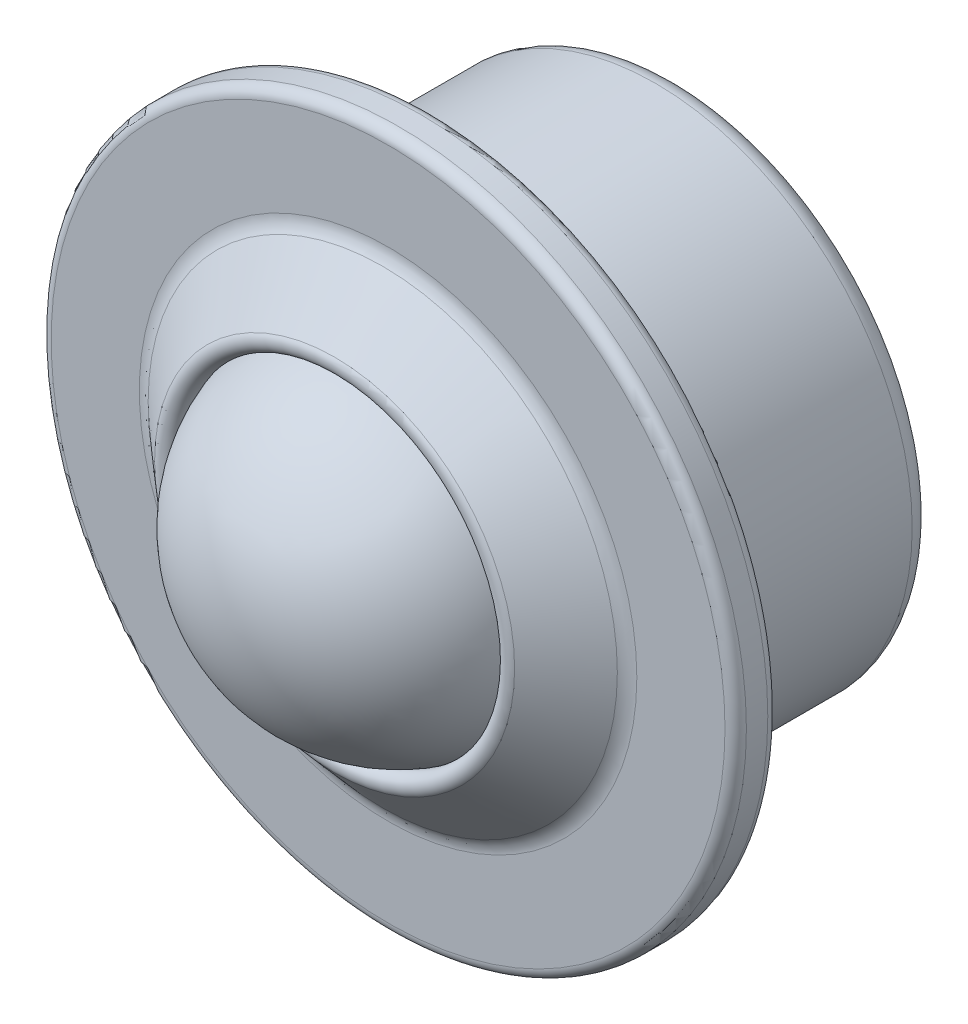
ISO-10303-21;
HEADER;
FILE_DESCRIPTION(('STEP AP214'),'2;1');
FILE_NAME('part.step','',(''),(''),'','','');
FILE_SCHEMA(('AUTOMOTIVE_DESIGN { 1 0 10303 214 1 1 1 1 }'));
ENDSEC;
DATA;
#1=APPLICATION_CONTEXT('core data for automotive mechanical design processes');
#2=APPLICATION_PROTOCOL_DEFINITION('international standard','automotive_design',2000,#1);
#3=PRODUCT_CONTEXT('',#1,'mechanical');
#4=PRODUCT('Part','Part','',(#3));
#5=PRODUCT_RELATED_PRODUCT_CATEGORY('part','',(#4));
#6=PRODUCT_DEFINITION_FORMATION('','',#4);
#7=PRODUCT_DEFINITION_CONTEXT('part definition',#1,'design');
#8=PRODUCT_DEFINITION('design','',#6,#7);
#9=PRODUCT_DEFINITION_SHAPE('','',#8);
#10=(LENGTH_UNIT() NAMED_UNIT(*) SI_UNIT(.MILLI.,.METRE.));
#11=(NAMED_UNIT(*) PLANE_ANGLE_UNIT() SI_UNIT($,.RADIAN.));
#12=(NAMED_UNIT(*) SI_UNIT($,.STERADIAN.) SOLID_ANGLE_UNIT());
#13=UNCERTAINTY_MEASURE_WITH_UNIT(LENGTH_MEASURE(1.E-05),#10,'distance_accuracy_value','');
#14=(GEOMETRIC_REPRESENTATION_CONTEXT(3) GLOBAL_UNCERTAINTY_ASSIGNED_CONTEXT((#13)) GLOBAL_UNIT_ASSIGNED_CONTEXT((#10,
#11,#12)) REPRESENTATION_CONTEXT('',''));
#15=CARTESIAN_POINT('',(0.,0.,0.));
#16=DIRECTION('',(0.,0.,1.));
#17=DIRECTION('',(1.,0.,0.));
#18=AXIS2_PLACEMENT_3D('',#15,#16,#17);
#19=CARTESIAN_POINT('',(0.,0.,0.));
#20=DIRECTION('',(0.,0.,-1.));
#21=DIRECTION('',(-1.,0.,0.));
#22=AXIS2_PLACEMENT_3D('',#19,#20,#21);
#23=PLANE('',#22);
#24=CARTESIAN_POINT('',(0.,0.,0.));
#25=DIRECTION('',(0.,0.,-1.));
#26=DIRECTION('',(-1.,0.,0.));
#27=AXIS2_PLACEMENT_3D('',#24,#25,#26);
#28=CIRCLE('',#27,11.);
#29=CARTESIAN_POINT('',(-11.,0.,0.));
#30=VERTEX_POINT('',#29);
#31=EDGE_CURVE('E43',#30,#30,#28,.T.);
#32=ORIENTED_EDGE('',*,*,#31,.T.);
#33=EDGE_LOOP('',(#32));
#34=FACE_BOUND('',#33,.T.);
#35=ADVANCED_FACE('F23',(#34),#23,.T.);
#36=CARTESIAN_POINT('',(0.,0.,13.));
#37=DIRECTION('',(0.,0.,1.));
#38=DIRECTION('',(-1.,0.,0.));
#39=AXIS2_PLACEMENT_3D('',#36,#37,#38);
#40=SPHERICAL_SURFACE('',#39,8.);
#41=CARTESIAN_POINT('',(0.,0.,15.4705863482928));
#42=DIRECTION('',(0.,0.,1.));
#43=DIRECTION('',(1.,0.,0.));
#44=AXIS2_PLACEMENT_3D('',#41,#42,#43);
#45=CIRCLE('',#44,7.60895545364996);
#46=CARTESIAN_POINT('',(7.60895545364996,0.,15.4705863482927));
#47=VERTEX_POINT('',#46);
#48=EDGE_CURVE('E55',#47,#47,#45,.T.);
#49=ORIENTED_EDGE('',*,*,#48,.T.);
#50=EDGE_LOOP('',(#49));
#51=FACE_BOUND('',#50,.T.);
#52=ADVANCED_FACE('F84',(#51),#40,.T.);
#53=CARTESIAN_POINT('',(0.,0.,15.6249979950611));
#54=DIRECTION('',(0.,0.,1.));
#55=DIRECTION('',(1.,0.,0.));
#56=AXIS2_PLACEMENT_3D('',#53,#54,#55);
#57=TOROIDAL_SURFACE('',#56,8.08451516950308,0.5);
#58=CARTESIAN_POINT('',(0.,0.,16.));
#59=DIRECTION('',(0.,0.,1.));
#60=DIRECTION('',(1.,0.,0.));
#61=AXIS2_PLACEMENT_3D('',#58,#59,#60);
#62=CIRCLE('',#61,8.41523180998521);
#63=CARTESIAN_POINT('',(8.41523180998521,0.,16.));
#64=VERTEX_POINT('',#63);
#65=EDGE_CURVE('E58',#64,#64,#62,.T.);
#66=ORIENTED_EDGE('',*,*,#65,.T.);
#67=EDGE_LOOP('',(#66));
#68=FACE_BOUND('',#67,.T.);
#69=ORIENTED_EDGE('',*,*,#48,.F.);
#70=EDGE_LOOP('',(#69));
#71=FACE_BOUND('',#70,.T.);
#72=ADVANCED_FACE('F90',(#68,#71),#57,.T.);
#73=CARTESIAN_POINT('',(0.,0.,16.));
#74=DIRECTION('',(0.,0.,-1.));
#75=DIRECTION('',(-1.,0.,0.));
#76=AXIS2_PLACEMENT_3D('',#73,#74,#75);
#77=CONICAL_SURFACE('',#76,8.41523180998521,0.848068141367787);
#78=CARTESIAN_POINT('',(0.,0.,13.7499959901222));
#79=DIRECTION('',(0.,0.,-1.));
#80=DIRECTION('',(-1.,0.,0.));
#81=AXIS2_PLACEMENT_3D('',#78,#79,#80);
#82=CIRCLE('',#81,10.9665277278282);
#83=CARTESIAN_POINT('',(-10.9665277278282,0.,13.7499959901222));
#84=VERTEX_POINT('',#83);
#85=EDGE_CURVE('E52',#84,#84,#82,.F.);
#86=ORIENTED_EDGE('',*,*,#85,.T.);
#87=EDGE_LOOP('',(#86));
#88=FACE_BOUND('',#87,.T.);
#89=ORIENTED_EDGE('',*,*,#65,.F.);
#90=EDGE_LOOP('',(#89));
#91=FACE_BOUND('',#90,.T.);
#92=ADVANCED_FACE('F114',(#88,#91),#77,.T.);
#93=CARTESIAN_POINT('',(-16.25,0.,13.5));
#94=DIRECTION('',(0.,0.,1.));
#95=DIRECTION('',(1.,0.,0.));
#96=AXIS2_PLACEMENT_3D('',#93,#94,#95);
#97=PLANE('',#96);
#98=CARTESIAN_POINT('',(0.,0.,13.5));
#99=DIRECTION('',(0.,0.,1.));
#100=DIRECTION('',(1.,0.,0.));
#101=AXIS2_PLACEMENT_3D('',#98,#99,#100);
#102=CIRCLE('',#101,15.75);
#103=CARTESIAN_POINT('',(15.75,0.,13.5));
#104=VERTEX_POINT('',#103);
#105=EDGE_CURVE('E30',#104,#104,#102,.T.);
#106=ORIENTED_EDGE('',*,*,#105,.T.);
#107=EDGE_LOOP('',(#106));
#108=FACE_BOUND('',#107,.T.);
#109=CARTESIAN_POINT('',(0.,0.,13.5));
#110=DIRECTION('',(0.,0.,1.));
#111=DIRECTION('',(1.,0.,0.));
#112=AXIS2_PLACEMENT_3D('',#109,#110,#111);
#113=CIRCLE('',#112,11.6279610087925);
#114=CARTESIAN_POINT('',(11.6279610087925,0.,13.5));
#115=VERTEX_POINT('',#114);
#116=EDGE_CURVE('E49',#115,#115,#113,.F.);
#117=ORIENTED_EDGE('',*,*,#116,.T.);
#118=EDGE_LOOP('',(#117));
#119=FACE_BOUND('',#118,.T.);
#120=ADVANCED_FACE('F109',(#108,#119),#97,.T.);
#121=CARTESIAN_POINT('',(0.,0.,-2.1));
#122=DIRECTION('',(0.,0.,1.));
#123=DIRECTION('',(1.,0.,0.));
#124=AXIS2_PLACEMENT_3D('',#121,#122,#123);
#125=CYLINDRICAL_SURFACE('',#124,16.25);
#126=CARTESIAN_POINT('',(0.,0.,13.));
#127=DIRECTION('',(0.,0.,1.));
#128=DIRECTION('',(1.,0.,0.));
#129=AXIS2_PLACEMENT_3D('',#126,#127,#128);
#130=CIRCLE('',#129,16.25);
#131=CARTESIAN_POINT('',(16.25,0.,13.));
#132=VERTEX_POINT('',#131);
#133=EDGE_CURVE('E12',#132,#132,#130,.F.);
#134=ORIENTED_EDGE('',*,*,#133,.T.);
#135=EDGE_LOOP('',(#134));
#136=FACE_BOUND('',#135,.T.);
#137=CARTESIAN_POINT('',(0.,0.,12.));
#138=DIRECTION('',(0.,0.,-1.));
#139=DIRECTION('',(-1.,0.,0.));
#140=AXIS2_PLACEMENT_3D('',#137,#138,#139);
#141=CIRCLE('',#140,16.25);
#142=CARTESIAN_POINT('',(-16.25,0.,12.));
#143=VERTEX_POINT('',#142);
#144=EDGE_CURVE('E38',#143,#143,#141,.F.);
#145=ORIENTED_EDGE('',*,*,#144,.T.);
#146=EDGE_LOOP('',(#145));
#147=FACE_BOUND('',#146,.T.);
#148=ADVANCED_FACE('F80',(#136,#147),#125,.T.);
#149=CARTESIAN_POINT('',(-12.,0.,11.5));
#150=DIRECTION('',(0.,0.,-1.));
#151=DIRECTION('',(-1.,0.,0.));
#152=AXIS2_PLACEMENT_3D('',#149,#150,#151);
#153=PLANE('',#152);
#154=CARTESIAN_POINT('',(0.,0.,11.5));
#155=DIRECTION('',(0.,0.,-1.));
#156=DIRECTION('',(-1.,0.,0.));
#157=AXIS2_PLACEMENT_3D('',#154,#155,#156);
#158=CIRCLE('',#157,15.75);
#159=CARTESIAN_POINT('',(-15.75,0.,11.5));
#160=VERTEX_POINT('',#159);
#161=EDGE_CURVE('E34',#160,#160,#158,.T.);
#162=ORIENTED_EDGE('',*,*,#161,.T.);
#163=EDGE_LOOP('',(#162));
#164=FACE_BOUND('',#163,.T.);
#165=CARTESIAN_POINT('',(0.,0.,11.5));
#166=DIRECTION('',(0.,0.,1.));
#167=DIRECTION('',(1.,0.,0.));
#168=AXIS2_PLACEMENT_3D('',#165,#166,#167);
#169=CIRCLE('',#168,12.);
#170=CARTESIAN_POINT('',(12.,0.,11.5));
#171=VERTEX_POINT('',#170);
#172=EDGE_CURVE('E61',#171,#171,#169,.T.);
#173=ORIENTED_EDGE('',*,*,#172,.T.);
#174=EDGE_LOOP('',(#173));
#175=FACE_BOUND('',#174,.T.);
#176=ADVANCED_FACE('F65',(#164,#175),#153,.T.);
#177=CARTESIAN_POINT('',(0.,0.,-2.1));
#178=DIRECTION('',(0.,0.,1.));
#179=DIRECTION('',(1.,0.,0.));
#180=AXIS2_PLACEMENT_3D('',#177,#178,#179);
#181=CYLINDRICAL_SURFACE('',#180,12.);
#182=CARTESIAN_POINT('',(0.,0.,1.));
#183=DIRECTION('',(0.,0.,-1.));
#184=DIRECTION('',(-1.,0.,0.));
#185=AXIS2_PLACEMENT_3D('',#182,#183,#184);
#186=CIRCLE('',#185,12.);
#187=CARTESIAN_POINT('',(-12.,0.,1.));
#188=VERTEX_POINT('',#187);
#189=EDGE_CURVE('E46',#188,#188,#186,.F.);
#190=ORIENTED_EDGE('',*,*,#189,.T.);
#191=EDGE_LOOP('',(#190));
#192=FACE_BOUND('',#191,.T.);
#193=ORIENTED_EDGE('',*,*,#172,.F.);
#194=EDGE_LOOP('',(#193));
#195=FACE_BOUND('',#194,.T.);
#196=ADVANCED_FACE('F67',(#192,#195),#181,.T.);
#197=CARTESIAN_POINT('',(0.,0.,14.5));
#198=DIRECTION('',(0.,0.,1.));
#199=DIRECTION('',(1.,0.,0.));
#200=AXIS2_PLACEMENT_3D('',#197,#198,#199);
#201=TOROIDAL_SURFACE('',#200,11.6279610087925,1.);
#202=ORIENTED_EDGE('',*,*,#116,.F.);
#203=EDGE_LOOP('',(#202));
#204=FACE_BOUND('',#203,.T.);
#205=ORIENTED_EDGE('',*,*,#85,.F.);
#206=EDGE_LOOP('',(#205));
#207=FACE_BOUND('',#206,.T.);
#208=ADVANCED_FACE('F69',(#204,#207),#201,.F.);
#209=CARTESIAN_POINT('',(0.,0.,1.));
#210=DIRECTION('',(0.,0.,-1.));
#211=DIRECTION('',(-1.,0.,0.));
#212=AXIS2_PLACEMENT_3D('',#209,#210,#211);
#213=TOROIDAL_SURFACE('',#212,11.,1.);
#214=ORIENTED_EDGE('',*,*,#31,.F.);
#215=EDGE_LOOP('',(#214));
#216=FACE_BOUND('',#215,.T.);
#217=ORIENTED_EDGE('',*,*,#189,.F.);
#218=EDGE_LOOP('',(#217));
#219=FACE_BOUND('',#218,.T.);
#220=ADVANCED_FACE('F77',(#216,#219),#213,.T.);
#221=CARTESIAN_POINT('',(0.,0.,12.));
#222=DIRECTION('',(0.,0.,-1.));
#223=DIRECTION('',(-1.,0.,0.));
#224=AXIS2_PLACEMENT_3D('',#221,#222,#223);
#225=TOROIDAL_SURFACE('',#224,15.75,0.5);
#226=ORIENTED_EDGE('',*,*,#161,.F.);
#227=EDGE_LOOP('',(#226));
#228=FACE_BOUND('',#227,.T.);
#229=ORIENTED_EDGE('',*,*,#144,.F.);
#230=EDGE_LOOP('',(#229));
#231=FACE_BOUND('',#230,.T.);
#232=ADVANCED_FACE('F96',(#228,#231),#225,.T.);
#233=CARTESIAN_POINT('',(0.,0.,13.));
#234=DIRECTION('',(0.,0.,1.));
#235=DIRECTION('',(1.,0.,0.));
#236=AXIS2_PLACEMENT_3D('',#233,#234,#235);
#237=TOROIDAL_SURFACE('',#236,15.75,0.5);
#238=ORIENTED_EDGE('',*,*,#133,.F.);
#239=EDGE_LOOP('',(#238));
#240=FACE_BOUND('',#239,.T.);
#241=ORIENTED_EDGE('',*,*,#105,.F.);
#242=EDGE_LOOP('',(#241));
#243=FACE_BOUND('',#242,.T.);
#244=ADVANCED_FACE('F25',(#240,#243),#237,.T.);
#245=CLOSED_SHELL('',(#35,#52,#72,#92,#120,#148,#176,#196,#208,#220,#232,#244));
#246=MANIFOLD_SOLID_BREP('B1',#245);
#247=ADVANCED_BREP_SHAPE_REPRESENTATION('',(#18,#246),#14);
#248=SHAPE_DEFINITION_REPRESENTATION(#9,#247);
ENDSEC;
END-ISO-10303-21;
